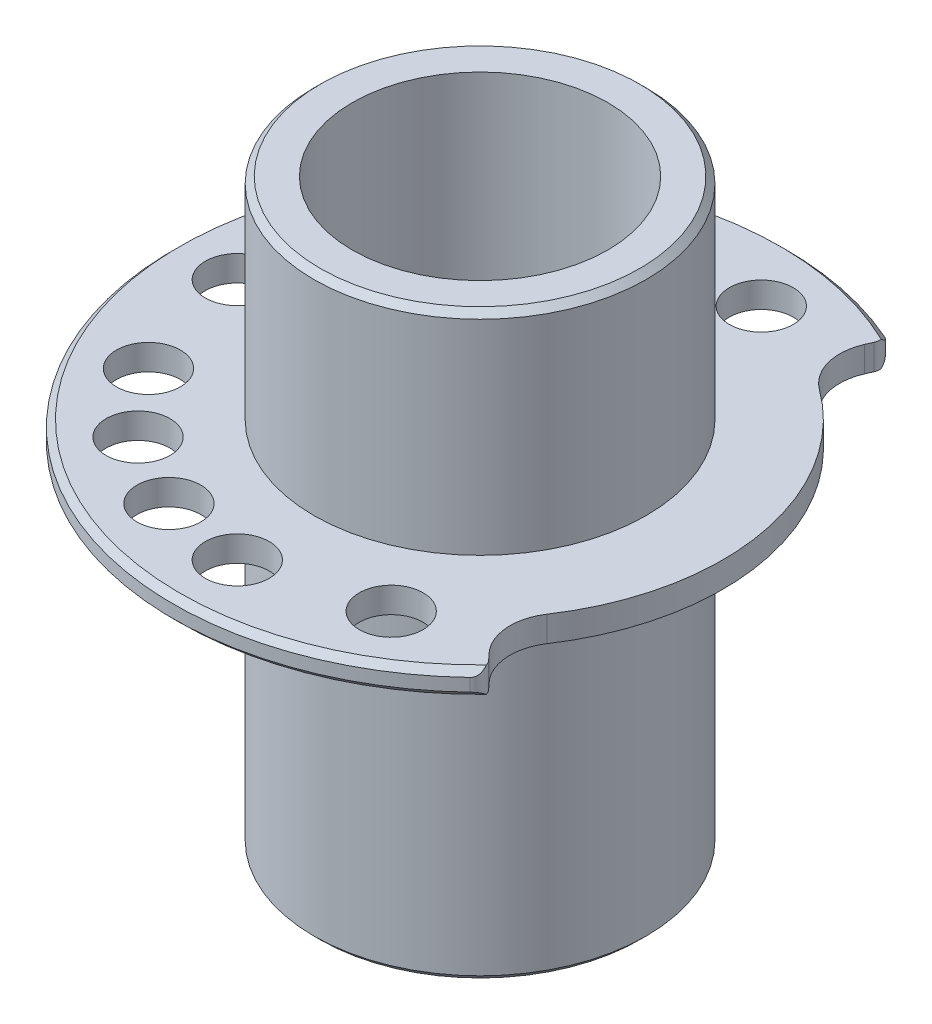
ISO-10303-21;
HEADER;
FILE_DESCRIPTION(('STEP AP214'),'2;1');
FILE_NAME('part.step','',(''),(''),'','','');
FILE_SCHEMA(('AUTOMOTIVE_DESIGN { 1 0 10303 214 1 1 1 1 }'));
ENDSEC;
DATA;
#1=APPLICATION_CONTEXT('core data for automotive mechanical design processes');
#2=APPLICATION_PROTOCOL_DEFINITION('international standard','automotive_design',2000,#1);
#3=PRODUCT_CONTEXT('',#1,'mechanical');
#4=PRODUCT('Part','Part','',(#3));
#5=PRODUCT_RELATED_PRODUCT_CATEGORY('part','',(#4));
#6=PRODUCT_DEFINITION_FORMATION('','',#4);
#7=PRODUCT_DEFINITION_CONTEXT('part definition',#1,'design');
#8=PRODUCT_DEFINITION('design','',#6,#7);
#9=PRODUCT_DEFINITION_SHAPE('','',#8);
#10=(LENGTH_UNIT() NAMED_UNIT(*) SI_UNIT(.MILLI.,.METRE.));
#11=(NAMED_UNIT(*) PLANE_ANGLE_UNIT() SI_UNIT($,.RADIAN.));
#12=(NAMED_UNIT(*) SI_UNIT($,.STERADIAN.) SOLID_ANGLE_UNIT());
#13=UNCERTAINTY_MEASURE_WITH_UNIT(LENGTH_MEASURE(1.E-05),#10,'distance_accuracy_value','');
#14=(GEOMETRIC_REPRESENTATION_CONTEXT(3) GLOBAL_UNCERTAINTY_ASSIGNED_CONTEXT((#13)) GLOBAL_UNIT_ASSIGNED_CONTEXT((#10,
#11,#12)) REPRESENTATION_CONTEXT('',''));
#15=CARTESIAN_POINT('',(0.,0.,0.));
#16=DIRECTION('',(0.,0.,1.));
#17=DIRECTION('',(1.,0.,0.));
#18=AXIS2_PLACEMENT_3D('',#15,#16,#17);
#19=CARTESIAN_POINT('',(0.,1.,0.));
#20=DIRECTION('',(0.,-1.,0.));
#21=DIRECTION('',(0.,0.,-1.));
#22=AXIS2_PLACEMENT_3D('',#19,#20,#21);
#23=CYLINDRICAL_SURFACE('',#22,10.);
#24=CARTESIAN_POINT('',(0.,-28.,0.));
#25=DIRECTION('',(0.,1.,0.));
#26=DIRECTION('',(0.,0.,1.));
#27=AXIS2_PLACEMENT_3D('',#24,#25,#26);
#28=CIRCLE('',#27,10.);
#29=CARTESIAN_POINT('',(0.,-28.,10.));
#30=VERTEX_POINT('',#29);
#31=EDGE_CURVE('E191',#30,#30,#28,.T.);
#32=ORIENTED_EDGE('',*,*,#31,.F.);
#33=EDGE_LOOP('',(#32));
#34=FACE_BOUND('',#33,.T.);
#35=CARTESIAN_POINT('',(0.,17.5,0.));
#36=DIRECTION('',(0.,1.,0.));
#37=DIRECTION('',(0.,0.,1.));
#38=AXIS2_PLACEMENT_3D('',#35,#36,#37);
#39=CIRCLE('',#38,10.);
#40=CARTESIAN_POINT('',(0.,17.5,10.));
#41=VERTEX_POINT('',#40);
#42=EDGE_CURVE('E186',#41,#41,#39,.T.);
#43=ORIENTED_EDGE('',*,*,#42,.T.);
#44=EDGE_LOOP('',(#43));
#45=FACE_BOUND('',#44,.T.);
#46=ADVANCED_FACE('F36',(#34,#45),#23,.F.);
#47=CARTESIAN_POINT('',(0.,1.,0.));
#48=DIRECTION('',(0.,-1.,0.));
#49=DIRECTION('',(0.,0.,-1.));
#50=AXIS2_PLACEMENT_3D('',#47,#48,#49);
#51=CYLINDRICAL_SURFACE('',#50,24.);
#52=CARTESIAN_POINT('',(0.,0.499999999999986,0.));
#53=DIRECTION('',(0.,1.,0.));
#54=DIRECTION('',(0.,0.,1.));
#55=AXIS2_PLACEMENT_3D('',#52,#53,#54);
#56=CIRCLE('',#55,24.);
#57=CARTESIAN_POINT('',(16.5812485743377,0.499999999999986,17.3511439310503));
#58=VERTEX_POINT('',#57);
#59=CARTESIAN_POINT('',(9.64683619455973,0.499999999999986,-21.9758629281158));
#60=VERTEX_POINT('',#59);
#61=EDGE_CURVE('E203',#58,#60,#56,.F.);
#62=ORIENTED_EDGE('',*,*,#61,.T.);
#63=DIRECTION('',(0.,-1.,0.));
#64=VECTOR('',#63,1.);
#65=CARTESIAN_POINT('',(9.64683619455973,1.,-21.9758629281158));
#66=LINE('',#65,#64);
#67=CARTESIAN_POINT('',(9.64683619455973,-0.499999999999993,-21.9758629281158));
#68=VERTEX_POINT('',#67);
#69=EDGE_CURVE('E335',#60,#68,#66,.T.);
#70=ORIENTED_EDGE('',*,*,#69,.T.);
#71=CARTESIAN_POINT('',(0.,-0.499999999999993,0.));
#72=DIRECTION('',(0.,1.,0.));
#73=DIRECTION('',(0.,0.,1.));
#74=AXIS2_PLACEMENT_3D('',#71,#72,#73);
#75=CIRCLE('',#74,24.);
#76=CARTESIAN_POINT('',(16.5812485743377,-0.499999999999993,17.3511439310503));
#77=VERTEX_POINT('',#76);
#78=EDGE_CURVE('E190',#68,#77,#75,.T.);
#79=ORIENTED_EDGE('',*,*,#78,.T.);
#80=DIRECTION('',(0.,-1.,0.));
#81=VECTOR('',#80,1.);
#82=CARTESIAN_POINT('',(16.5812485743377,1.,17.3511439310503));
#83=LINE('',#82,#81);
#84=EDGE_CURVE('E332',#77,#58,#83,.F.);
#85=ORIENTED_EDGE('',*,*,#84,.T.);
#86=EDGE_LOOP('',(#62,#70,#79,#85));
#87=FACE_BOUND('',#86,.T.);
#88=ADVANCED_FACE('F334',(#87),#51,.T.);
#89=CARTESIAN_POINT('',(0.,1.,0.));
#90=DIRECTION('',(0.,1.,0.));
#91=DIRECTION('',(0.,0.,1.));
#92=AXIS2_PLACEMENT_3D('',#89,#90,#91);
#93=PLANE('',#92);
#94=DIRECTION('',(-0.401951508106656,0.,0.915660955338156));
#95=VECTOR('',#94,1.);
#96=CARTESIAN_POINT('',(8.54215460267814,1.,-16.9714935920191));
#97=LINE('',#96,#95);
#98=CARTESIAN_POINT('',(10.1605456417912,1.,-20.6582504646709));
#99=VERTEX_POINT('',#98);
#100=CARTESIAN_POINT('',(9.93944993193131,1.,-20.1545859558223));
#101=VERTEX_POINT('',#100);
#102=EDGE_CURVE('E145',#99,#101,#97,.T.);
#103=ORIENTED_EDGE('',*,*,#102,.F.);
#104=CARTESIAN_POINT('',(9.24488468645307,1.,-21.0602019727776));
#105=DIRECTION('',(0.,1.,0.));
#106=DIRECTION('',(0.,0.,1.));
#107=AXIS2_PLACEMENT_3D('',#104,#105,#106);
#108=CIRCLE('',#107,1.);
#109=CARTESIAN_POINT('',(10.2407265560331,1.,-21.1513006598781));
#110=VERTEX_POINT('',#109);
#111=EDGE_CURVE('E255',#99,#110,#108,.T.);
#112=ORIENTED_EDGE('',*,*,#111,.T.);
#113=CARTESIAN_POINT('',(0.,1.,0.));
#114=DIRECTION('',(0.,1.,0.));
#115=DIRECTION('',(0.,0.,1.));
#116=AXIS2_PLACEMENT_3D('',#113,#114,#115);
#117=CIRCLE('',#116,23.5);
#118=CARTESIAN_POINT('',(16.8573060594065,1.,16.373186385658));
#119=VERTEX_POINT('',#118);
#120=EDGE_CURVE('E201',#110,#119,#117,.T.);
#121=ORIENTED_EDGE('',*,*,#120,.T.);
#122=CARTESIAN_POINT('',(15.8903632170736,1.,16.6281796005899));
#123=DIRECTION('',(0.,1.,0.));
#124=DIRECTION('',(0.,0.,1.));
#125=AXIS2_PLACEMENT_3D('',#122,#123,#124);
#126=CIRCLE('',#125,1.);
#127=CARTESIAN_POINT('',(16.6133275475341,1.,15.9372942433258));
#128=VERTEX_POINT('',#127);
#129=EDGE_CURVE('E140',#119,#128,#126,.T.);
#130=ORIENTED_EDGE('',*,*,#129,.T.);
#131=DIRECTION('',(0.690885357264071,0.,0.722964330460429));
#132=VECTOR('',#131,1.);
#133=CARTESIAN_POINT('',(13.8315923165422,1.,13.0263983506176));
#134=LINE('',#133,#132);
#135=CARTESIAN_POINT('',(16.2333021329868,1.,15.539623607384));
#136=VERTEX_POINT('',#135);
#137=EDGE_CURVE('E130',#136,#128,#134,.T.);
#138=ORIENTED_EDGE('',*,*,#137,.F.);
#139=CARTESIAN_POINT('',(19.1251594548285,1.,12.7760821783277));
#140=DIRECTION('',(0.,1.,0.));
#141=DIRECTION('',(0.,0.,1.));
#142=AXIS2_PLACEMENT_3D('',#139,#140,#141);
#143=CIRCLE('',#142,4.);
#144=CARTESIAN_POINT('',(15.7990447670323,1.,10.5541548429664));
#145=VERTEX_POINT('',#144);
#146=EDGE_CURVE('E116',#136,#145,#143,.F.);
#147=ORIENTED_EDGE('',*,*,#146,.T.);
#148=CARTESIAN_POINT('',(0.,1.,0.));
#149=DIRECTION('',(0.,-1.,0.));
#150=DIRECTION('',(0.,0.,1.));
#151=AXIS2_PLACEMENT_3D('',#148,#149,#150);
#152=CIRCLE('',#151,19.);
#153=CARTESIAN_POINT('',(11.2365122309737,1.,-15.3212529801965));
#154=VERTEX_POINT('',#153);
#155=EDGE_CURVE('E142',#154,#145,#152,.T.);
#156=ORIENTED_EDGE('',*,*,#155,.F.);
#157=CARTESIAN_POINT('',(13.6020937532839,1.,-18.5467799233957));
#158=DIRECTION('',(0.,1.,0.));
#159=DIRECTION('',(0.,0.,1.));
#160=AXIS2_PLACEMENT_3D('',#157,#158,#159);
#161=CIRCLE('',#160,4.);
#162=EDGE_CURVE('E246',#154,#101,#161,.F.);
#163=ORIENTED_EDGE('',*,*,#162,.T.);
#164=EDGE_LOOP('',(#103,#112,#121,#130,#138,#147,#156,#163));
#165=FACE_BOUND('',#164,.T.);
#166=CARTESIAN_POINT('',(-19.,1.,0.));
#167=DIRECTION('',(0.,1.,0.));
#168=DIRECTION('',(0.,0.,1.));
#169=AXIS2_PLACEMENT_3D('',#166,#167,#168);
#170=CIRCLE('',#169,2.5);
#171=CARTESIAN_POINT('',(-19.,1.,2.5));
#172=VERTEX_POINT('',#171);
#173=EDGE_CURVE('E183',#172,#172,#170,.T.);
#174=ORIENTED_EDGE('',*,*,#173,.F.);
#175=EDGE_LOOP('',(#174));
#176=FACE_BOUND('',#175,.T.);
#177=CARTESIAN_POINT('',(9.50000000000002,1.,16.4544826719043));
#178=DIRECTION('',(0.,1.,0.));
#179=DIRECTION('',(0.,0.,1.));
#180=AXIS2_PLACEMENT_3D('',#177,#178,#179);
#181=CIRCLE('',#180,2.5);
#182=CARTESIAN_POINT('',(9.50000000000002,1.,18.9544826719043));
#183=VERTEX_POINT('',#182);
#184=EDGE_CURVE('E179',#183,#183,#181,.T.);
#185=ORIENTED_EDGE('',*,*,#184,.F.);
#186=EDGE_LOOP('',(#185));
#187=FACE_BOUND('',#186,.T.);
#188=CARTESIAN_POINT('',(-6.49793606735281,1.,17.8529326181116));
#189=DIRECTION('',(0.,1.,0.));
#190=DIRECTION('',(0.,0.,1.));
#191=AXIS2_PLACEMENT_3D('',#188,#189,#190);
#192=CIRCLE('',#191,2.5);
#193=CARTESIAN_POINT('',(-6.49793606735281,1.,20.3529326181116));
#194=VERTEX_POINT('',#193);
#195=EDGE_CURVE('E175',#194,#194,#192,.T.);
#196=ORIENTED_EDGE('',*,*,#195,.F.);
#197=EDGE_LOOP('',(#196));
#198=FACE_BOUND('',#197,.T.);
#199=CARTESIAN_POINT('',(3.29931537567156,1.,-18.711347307232));
#200=DIRECTION('',(0.,1.,0.));
#201=DIRECTION('',(0.,0.,1.));
#202=AXIS2_PLACEMENT_3D('',#199,#200,#201);
#203=CIRCLE('',#202,2.5);
#204=CARTESIAN_POINT('',(3.29931537567156,1.,-16.211347307232));
#205=VERTEX_POINT('',#204);
#206=EDGE_CURVE('E171',#205,#205,#203,.T.);
#207=ORIENTED_EDGE('',*,*,#206,.F.);
#208=EDGE_LOOP('',(#207));
#209=FACE_BOUND('',#208,.T.);
#210=CARTESIAN_POINT('',(-16.4544826719044,1.,9.49999999999996));
#211=DIRECTION('',(0.,1.,0.));
#212=DIRECTION('',(0.,0.,1.));
#213=AXIS2_PLACEMENT_3D('',#210,#211,#212);
#214=CIRCLE('',#213,2.5);
#215=CARTESIAN_POINT('',(-16.4544826719044,1.,12.));
#216=VERTEX_POINT('',#215);
#217=EDGE_CURVE('E167',#216,#216,#214,.T.);
#218=ORIENTED_EDGE('',*,*,#217,.F.);
#219=EDGE_LOOP('',(#218));
#220=FACE_BOUND('',#219,.T.);
#221=CARTESIAN_POINT('',(-14.5754053366783,1.,-12.2302172422662));
#222=DIRECTION('',(0.,1.,0.));
#223=DIRECTION('',(0.,0.,1.));
#224=AXIS2_PLACEMENT_3D('',#221,#222,#223);
#225=CIRCLE('',#224,2.5);
#226=CARTESIAN_POINT('',(-14.5754053366783,1.,-9.73021724226621));
#227=VERTEX_POINT('',#226);
#228=EDGE_CURVE('E163',#227,#227,#225,.T.);
#229=ORIENTED_EDGE('',*,*,#228,.F.);
#230=EDGE_LOOP('',(#229));
#231=FACE_BOUND('',#230,.T.);
#232=CARTESIAN_POINT('',(-12.2129645840443,1.,14.5548444192606));
#233=DIRECTION('',(0.,1.,0.));
#234=DIRECTION('',(0.,0.,1.));
#235=AXIS2_PLACEMENT_3D('',#232,#233,#234);
#236=CIRCLE('',#235,2.5);
#237=CARTESIAN_POINT('',(-12.2129645840443,1.,17.0548444192606));
#238=VERTEX_POINT('',#237);
#239=EDGE_CURVE('E159',#238,#238,#236,.T.);
#240=ORIENTED_EDGE('',*,*,#239,.F.);
#241=EDGE_LOOP('',(#240));
#242=FACE_BOUND('',#241,.T.);
#243=CARTESIAN_POINT('',(-8.02974697307318,1.,-17.2198479536964));
#244=DIRECTION('',(0.,1.,0.));
#245=DIRECTION('',(0.,0.,1.));
#246=AXIS2_PLACEMENT_3D('',#243,#244,#245);
#247=CIRCLE('',#246,2.5);
#248=CARTESIAN_POINT('',(-8.02974697307318,1.,-14.7198479536964));
#249=VERTEX_POINT('',#248);
#250=EDGE_CURVE('E155',#249,#249,#247,.T.);
#251=ORIENTED_EDGE('',*,*,#250,.F.);
#252=EDGE_LOOP('',(#251));
#253=FACE_BOUND('',#252,.T.);
#254=CARTESIAN_POINT('',(0.,1.,19.));
#255=DIRECTION('',(0.,1.,0.));
#256=DIRECTION('',(0.,0.,1.));
#257=AXIS2_PLACEMENT_3D('',#254,#255,#256);
#258=CIRCLE('',#257,2.5);
#259=CARTESIAN_POINT('',(0.,1.,21.5));
#260=VERTEX_POINT('',#259);
#261=EDGE_CURVE('E151',#260,#260,#258,.T.);
#262=ORIENTED_EDGE('',*,*,#261,.F.);
#263=EDGE_LOOP('',(#262));
#264=FACE_BOUND('',#263,.T.);
#265=CARTESIAN_POINT('',(0.,1.,0.));
#266=DIRECTION('',(0.,1.,0.));
#267=DIRECTION('',(0.,0.,1.));
#268=AXIS2_PLACEMENT_3D('',#265,#266,#267);
#269=CIRCLE('',#268,13.);
#270=CARTESIAN_POINT('',(0.,1.,13.));
#271=VERTEX_POINT('',#270);
#272=EDGE_CURVE('E194',#271,#271,#269,.F.);
#273=ORIENTED_EDGE('',*,*,#272,.T.);
#274=EDGE_LOOP('',(#273));
#275=FACE_BOUND('',#274,.T.);
#276=ADVANCED_FACE('F136',(#165,#176,#187,#198,#209,#220,#231,#242,#253,#264,#275),#93,.T.);
#277=CARTESIAN_POINT('',(0.,-1.,0.));
#278=DIRECTION('',(0.,1.,0.));
#279=DIRECTION('',(0.,0.,1.));
#280=AXIS2_PLACEMENT_3D('',#277,#278,#279);
#281=PLANE('',#280);
#282=CARTESIAN_POINT('',(-19.,-1.,0.));
#283=DIRECTION('',(0.,1.,0.));
#284=DIRECTION('',(0.,0.,1.));
#285=AXIS2_PLACEMENT_3D('',#282,#283,#284);
#286=CIRCLE('',#285,2.5);
#287=CARTESIAN_POINT('',(-19.,-1.,2.5));
#288=VERTEX_POINT('',#287);
#289=EDGE_CURVE('E182',#288,#288,#286,.T.);
#290=ORIENTED_EDGE('',*,*,#289,.T.);
#291=EDGE_LOOP('',(#290));
#292=FACE_BOUND('',#291,.T.);
#293=CARTESIAN_POINT('',(9.50000000000002,-1.,16.4544826719043));
#294=DIRECTION('',(0.,1.,0.));
#295=DIRECTION('',(0.,0.,1.));
#296=AXIS2_PLACEMENT_3D('',#293,#294,#295);
#297=CIRCLE('',#296,2.5);
#298=CARTESIAN_POINT('',(9.50000000000002,-1.,18.9544826719043));
#299=VERTEX_POINT('',#298);
#300=EDGE_CURVE('E178',#299,#299,#297,.T.);
#301=ORIENTED_EDGE('',*,*,#300,.T.);
#302=EDGE_LOOP('',(#301));
#303=FACE_BOUND('',#302,.T.);
#304=CARTESIAN_POINT('',(-6.49793606735281,-1.,17.8529326181116));
#305=DIRECTION('',(0.,1.,0.));
#306=DIRECTION('',(0.,0.,1.));
#307=AXIS2_PLACEMENT_3D('',#304,#305,#306);
#308=CIRCLE('',#307,2.5);
#309=CARTESIAN_POINT('',(-6.49793606735281,-1.,20.3529326181116));
#310=VERTEX_POINT('',#309);
#311=EDGE_CURVE('E174',#310,#310,#308,.T.);
#312=ORIENTED_EDGE('',*,*,#311,.T.);
#313=EDGE_LOOP('',(#312));
#314=FACE_BOUND('',#313,.T.);
#315=CARTESIAN_POINT('',(3.29931537567156,-1.,-18.711347307232));
#316=DIRECTION('',(0.,1.,0.));
#317=DIRECTION('',(0.,0.,1.));
#318=AXIS2_PLACEMENT_3D('',#315,#316,#317);
#319=CIRCLE('',#318,2.5);
#320=CARTESIAN_POINT('',(3.29931537567156,-1.,-16.211347307232));
#321=VERTEX_POINT('',#320);
#322=EDGE_CURVE('E170',#321,#321,#319,.T.);
#323=ORIENTED_EDGE('',*,*,#322,.T.);
#324=EDGE_LOOP('',(#323));
#325=FACE_BOUND('',#324,.T.);
#326=CARTESIAN_POINT('',(-16.4544826719044,-1.,9.49999999999996));
#327=DIRECTION('',(0.,1.,0.));
#328=DIRECTION('',(0.,0.,1.));
#329=AXIS2_PLACEMENT_3D('',#326,#327,#328);
#330=CIRCLE('',#329,2.5);
#331=CARTESIAN_POINT('',(-16.4544826719044,-1.,12.));
#332=VERTEX_POINT('',#331);
#333=EDGE_CURVE('E166',#332,#332,#330,.T.);
#334=ORIENTED_EDGE('',*,*,#333,.T.);
#335=EDGE_LOOP('',(#334));
#336=FACE_BOUND('',#335,.T.);
#337=CARTESIAN_POINT('',(-14.5754053366783,-1.,-12.2302172422662));
#338=DIRECTION('',(0.,1.,0.));
#339=DIRECTION('',(0.,0.,1.));
#340=AXIS2_PLACEMENT_3D('',#337,#338,#339);
#341=CIRCLE('',#340,2.5);
#342=CARTESIAN_POINT('',(-14.5754053366783,-1.,-9.73021724226621));
#343=VERTEX_POINT('',#342);
#344=EDGE_CURVE('E162',#343,#343,#341,.T.);
#345=ORIENTED_EDGE('',*,*,#344,.T.);
#346=EDGE_LOOP('',(#345));
#347=FACE_BOUND('',#346,.T.);
#348=CARTESIAN_POINT('',(-12.2129645840443,-1.,14.5548444192606));
#349=DIRECTION('',(0.,1.,0.));
#350=DIRECTION('',(0.,0.,1.));
#351=AXIS2_PLACEMENT_3D('',#348,#349,#350);
#352=CIRCLE('',#351,2.5);
#353=CARTESIAN_POINT('',(-12.2129645840443,-1.,17.0548444192606));
#354=VERTEX_POINT('',#353);
#355=EDGE_CURVE('E158',#354,#354,#352,.T.);
#356=ORIENTED_EDGE('',*,*,#355,.T.);
#357=EDGE_LOOP('',(#356));
#358=FACE_BOUND('',#357,.T.);
#359=CARTESIAN_POINT('',(-8.02974697307318,-1.,-17.2198479536964));
#360=DIRECTION('',(0.,1.,0.));
#361=DIRECTION('',(0.,0.,1.));
#362=AXIS2_PLACEMENT_3D('',#359,#360,#361);
#363=CIRCLE('',#362,2.5);
#364=CARTESIAN_POINT('',(-8.02974697307318,-1.,-14.7198479536964));
#365=VERTEX_POINT('',#364);
#366=EDGE_CURVE('E154',#365,#365,#363,.T.);
#367=ORIENTED_EDGE('',*,*,#366,.T.);
#368=EDGE_LOOP('',(#367));
#369=FACE_BOUND('',#368,.T.);
#370=CARTESIAN_POINT('',(0.,-1.,19.));
#371=DIRECTION('',(0.,1.,0.));
#372=DIRECTION('',(0.,0.,1.));
#373=AXIS2_PLACEMENT_3D('',#370,#371,#372);
#374=CIRCLE('',#373,2.5);
#375=CARTESIAN_POINT('',(0.,-1.,21.5));
#376=VERTEX_POINT('',#375);
#377=EDGE_CURVE('E150',#376,#376,#374,.T.);
#378=ORIENTED_EDGE('',*,*,#377,.T.);
#379=EDGE_LOOP('',(#378));
#380=FACE_BOUND('',#379,.T.);
#381=CARTESIAN_POINT('',(0.,-1.,0.));
#382=DIRECTION('',(0.,1.,0.));
#383=DIRECTION('',(0.,0.,1.));
#384=AXIS2_PLACEMENT_3D('',#381,#382,#383);
#385=CIRCLE('',#384,23.5);
#386=CARTESIAN_POINT('',(16.8573060594065,-1.,16.373186385658));
#387=VERTEX_POINT('',#386);
#388=CARTESIAN_POINT('',(10.240726556033,-1.,-21.1513006598781));
#389=VERTEX_POINT('',#388);
#390=EDGE_CURVE('E199',#387,#389,#385,.F.);
#391=ORIENTED_EDGE('',*,*,#390,.T.);
#392=CARTESIAN_POINT('',(9.24488468645307,-1.,-21.0602019727776));
#393=DIRECTION('',(0.,1.,0.));
#394=DIRECTION('',(0.,0.,1.));
#395=AXIS2_PLACEMENT_3D('',#392,#393,#394);
#396=CIRCLE('',#395,1.);
#397=CARTESIAN_POINT('',(10.1605456417912,-1.,-20.6582504646709));
#398=VERTEX_POINT('',#397);
#399=EDGE_CURVE('E45',#389,#398,#396,.F.);
#400=ORIENTED_EDGE('',*,*,#399,.T.);
#401=DIRECTION('',(-0.401951508106656,0.,0.915660955338156));
#402=VECTOR('',#401,1.);
#403=CARTESIAN_POINT('',(0.915660955338128,-1.,0.401951508106644));
#404=LINE('',#403,#402);
#405=CARTESIAN_POINT('',(9.93944993193131,-1.,-20.1545859558223));
#406=VERTEX_POINT('',#405);
#407=EDGE_CURVE('E141',#398,#406,#404,.T.);
#408=ORIENTED_EDGE('',*,*,#407,.T.);
#409=CARTESIAN_POINT('',(13.6020937532839,-1.,-18.5467799233957));
#410=DIRECTION('',(0.,1.,0.));
#411=DIRECTION('',(0.,0.,1.));
#412=AXIS2_PLACEMENT_3D('',#409,#410,#411);
#413=CIRCLE('',#412,4.);
#414=CARTESIAN_POINT('',(11.2365122309737,-1.,-15.3212529801965));
#415=VERTEX_POINT('',#414);
#416=EDGE_CURVE('E249',#406,#415,#413,.T.);
#417=ORIENTED_EDGE('',*,*,#416,.T.);
#418=CARTESIAN_POINT('',(0.,-1.,0.));
#419=DIRECTION('',(0.,1.,0.));
#420=DIRECTION('',(0.,0.,1.));
#421=AXIS2_PLACEMENT_3D('',#418,#419,#420);
#422=CIRCLE('',#421,19.);
#423=CARTESIAN_POINT('',(15.7990447670323,-1.,10.5541548429664));
#424=VERTEX_POINT('',#423);
#425=EDGE_CURVE('E133',#415,#424,#422,.F.);
#426=ORIENTED_EDGE('',*,*,#425,.T.);
#427=CARTESIAN_POINT('',(19.1251594548285,-1.,12.7760821783277));
#428=DIRECTION('',(0.,1.,0.));
#429=DIRECTION('',(0.,0.,1.));
#430=AXIS2_PLACEMENT_3D('',#427,#428,#429);
#431=CIRCLE('',#430,4.);
#432=CARTESIAN_POINT('',(16.2333021329868,-1.,15.539623607384));
#433=VERTEX_POINT('',#432);
#434=EDGE_CURVE('E126',#424,#433,#431,.T.);
#435=ORIENTED_EDGE('',*,*,#434,.T.);
#436=DIRECTION('',(0.690885357264071,0.,0.722964330460429));
#437=VECTOR('',#436,1.);
#438=CARTESIAN_POINT('',(0.722964330460431,-1.,-0.690885357264073));
#439=LINE('',#438,#437);
#440=CARTESIAN_POINT('',(16.6133275475341,-1.,15.9372942433258));
#441=VERTEX_POINT('',#440);
#442=EDGE_CURVE('E131',#433,#441,#439,.T.);
#443=ORIENTED_EDGE('',*,*,#442,.T.);
#444=CARTESIAN_POINT('',(15.8903632170736,-1.,16.6281796005899));
#445=DIRECTION('',(0.,1.,0.));
#446=DIRECTION('',(0.,0.,1.));
#447=AXIS2_PLACEMENT_3D('',#444,#445,#446);
#448=CIRCLE('',#447,1.);
#449=EDGE_CURVE('E307',#441,#387,#448,.F.);
#450=ORIENTED_EDGE('',*,*,#449,.T.);
#451=EDGE_LOOP('',(#391,#400,#408,#417,#426,#435,#443,#450));
#452=FACE_BOUND('',#451,.T.);
#453=CARTESIAN_POINT('',(0.,-1.,0.));
#454=DIRECTION('',(0.,1.,0.));
#455=DIRECTION('',(0.,0.,1.));
#456=AXIS2_PLACEMENT_3D('',#453,#454,#455);
#457=CIRCLE('',#456,13.);
#458=CARTESIAN_POINT('',(0.,-1.,13.));
#459=VERTEX_POINT('',#458);
#460=EDGE_CURVE('E187',#459,#459,#457,.F.);
#461=ORIENTED_EDGE('',*,*,#460,.F.);
#462=EDGE_LOOP('',(#461));
#463=FACE_BOUND('',#462,.T.);
#464=ADVANCED_FACE('F317',(#292,#303,#314,#325,#336,#347,#358,#369,#380,#452,#463),#281,.F.);
#465=CARTESIAN_POINT('',(0.,-28.,0.));
#466=DIRECTION('',(0.,1.,0.));
#467=DIRECTION('',(0.,0.,1.));
#468=AXIS2_PLACEMENT_3D('',#465,#466,#467);
#469=CYLINDRICAL_SURFACE('',#468,13.);
#470=CARTESIAN_POINT('',(0.,-27.5,0.));
#471=DIRECTION('',(0.,1.,0.));
#472=DIRECTION('',(0.,0.,1.));
#473=AXIS2_PLACEMENT_3D('',#470,#471,#472);
#474=CIRCLE('',#473,13.);
#475=CARTESIAN_POINT('',(0.,-27.5,13.));
#476=VERTEX_POINT('',#475);
#477=EDGE_CURVE('E206',#476,#476,#474,.T.);
#478=ORIENTED_EDGE('',*,*,#477,.T.);
#479=EDGE_LOOP('',(#478));
#480=FACE_BOUND('',#479,.T.);
#481=ORIENTED_EDGE('',*,*,#460,.T.);
#482=EDGE_LOOP('',(#481));
#483=FACE_BOUND('',#482,.T.);
#484=ADVANCED_FACE('F368',(#480,#483),#469,.T.);
#485=CARTESIAN_POINT('',(0.,-28.,0.));
#486=DIRECTION('',(0.,1.,0.));
#487=DIRECTION('',(0.,0.,1.));
#488=AXIS2_PLACEMENT_3D('',#485,#486,#487);
#489=PLANE('',#488);
#490=CARTESIAN_POINT('',(0.,-28.,0.));
#491=DIRECTION('',(0.,1.,0.));
#492=DIRECTION('',(0.,0.,1.));
#493=AXIS2_PLACEMENT_3D('',#490,#491,#492);
#494=CIRCLE('',#493,12.5);
#495=CARTESIAN_POINT('',(0.,-28.,12.5));
#496=VERTEX_POINT('',#495);
#497=EDGE_CURVE('E209',#496,#496,#494,.F.);
#498=ORIENTED_EDGE('',*,*,#497,.T.);
#499=EDGE_LOOP('',(#498));
#500=FACE_BOUND('',#499,.T.);
#501=ORIENTED_EDGE('',*,*,#31,.T.);
#502=EDGE_LOOP('',(#501));
#503=FACE_BOUND('',#502,.T.);
#504=ADVANCED_FACE('F371',(#500,#503),#489,.F.);
#505=CARTESIAN_POINT('',(0.,17.5,0.));
#506=DIRECTION('',(0.,-1.,0.));
#507=DIRECTION('',(0.,0.,-1.));
#508=AXIS2_PLACEMENT_3D('',#505,#506,#507);
#509=CYLINDRICAL_SURFACE('',#508,13.);
#510=CARTESIAN_POINT('',(0.,17.,0.));
#511=DIRECTION('',(0.,1.,0.));
#512=DIRECTION('',(0.,0.,1.));
#513=AXIS2_PLACEMENT_3D('',#510,#511,#512);
#514=CIRCLE('',#513,13.);
#515=CARTESIAN_POINT('',(0.,17.,13.));
#516=VERTEX_POINT('',#515);
#517=EDGE_CURVE('E217',#516,#516,#514,.F.);
#518=ORIENTED_EDGE('',*,*,#517,.T.);
#519=EDGE_LOOP('',(#518));
#520=FACE_BOUND('',#519,.T.);
#521=ORIENTED_EDGE('',*,*,#272,.F.);
#522=EDGE_LOOP('',(#521));
#523=FACE_BOUND('',#522,.T.);
#524=ADVANCED_FACE('F363',(#520,#523),#509,.T.);
#525=CARTESIAN_POINT('',(0.,17.5,0.));
#526=DIRECTION('',(0.,1.,0.));
#527=DIRECTION('',(0.,0.,1.));
#528=AXIS2_PLACEMENT_3D('',#525,#526,#527);
#529=PLANE('',#528);
#530=CARTESIAN_POINT('',(0.,17.5,0.));
#531=DIRECTION('',(0.,1.,0.));
#532=DIRECTION('',(0.,0.,1.));
#533=AXIS2_PLACEMENT_3D('',#530,#531,#532);
#534=CIRCLE('',#533,12.5);
#535=CARTESIAN_POINT('',(0.,17.5,12.5));
#536=VERTEX_POINT('',#535);
#537=EDGE_CURVE('E212',#536,#536,#534,.T.);
#538=ORIENTED_EDGE('',*,*,#537,.T.);
#539=EDGE_LOOP('',(#538));
#540=FACE_BOUND('',#539,.T.);
#541=ORIENTED_EDGE('',*,*,#42,.F.);
#542=EDGE_LOOP('',(#541));
#543=FACE_BOUND('',#542,.T.);
#544=ADVANCED_FACE('F395',(#540,#543),#529,.T.);
#545=CARTESIAN_POINT('',(0.,-0.499999999999993,0.));
#546=DIRECTION('',(0.,1.,0.));
#547=DIRECTION('',(0.,0.,1.));
#548=AXIS2_PLACEMENT_3D('',#545,#546,#547);
#549=CONICAL_SURFACE('',#548,24.,0.785398163397448);
#550=ORIENTED_EDGE('',*,*,#78,.F.);
#551=CARTESIAN_POINT('',(9.64683619455973,-0.499999999999993,-21.9758629281158));
#552=CARTESIAN_POINT('',(9.66758984804915,-0.499997361037034,-21.9667557469492));
#553=CARTESIAN_POINT('',(9.68801870677943,-0.50073901557201,-21.9569426830524));
#554=CARTESIAN_POINT('',(9.72806951515627,-0.503679050760108,-21.9360112311293));
#555=CARTESIAN_POINT('',(9.74769203051387,-0.505876390946741,-21.9248937800943));
#556=CARTESIAN_POINT('',(9.80482128402231,-0.514554642289489,-21.8899294312927));
#557=CARTESIAN_POINT('',(9.84095947165225,-0.523123058893588,-21.864306742837));
#558=CARTESIAN_POINT('',(9.90852139929597,-0.545204066509054,-21.8095214595563));
#559=CARTESIAN_POINT('',(9.93995625903215,-0.558704727651295,-21.7803675187447));
#560=CARTESIAN_POINT('',(9.99795300071954,-0.58988160895553,-21.7194895383163));
#561=CARTESIAN_POINT('',(10.0245055787625,-0.607565657570444,-21.6877607543763));
#562=CARTESIAN_POINT('',(10.0819155269648,-0.653741602025029,-21.6102161421117));
#563=CARTESIAN_POINT('',(10.1105252546683,-0.683778607625031,-21.5636601358511));
#564=CARTESIAN_POINT('',(10.1589692895946,-0.748589977364394,-21.4692011383698));
#565=CARTESIAN_POINT('',(10.1787777968114,-0.783377883709377,-21.4212946191054));
#566=CARTESIAN_POINT('',(10.2069074352445,-0.848256495368915,-21.3359966590808));
#567=CARTESIAN_POINT('',(10.2167963896843,-0.877699399901134,-21.2986080386712));
#568=CARTESIAN_POINT('',(10.2320174867299,-0.937917745163764,-21.2244680115807));
#569=CARTESIAN_POINT('',(10.2373849976941,-0.968680826753673,-21.1877139044758));
#570=CARTESIAN_POINT('',(10.2407265560331,-1.,-21.1513006598781));
#571=B_SPLINE_CURVE_WITH_KNOTS('',3,(#551,#552,#553,#554,#555,#556,#557,#558,#559,#560,#561,
#562,#563,#564,#565,#566,#567,#568,#569,#570),.UNSPECIFIED.,.F.,.F.,(4,2,2,2,2,2,2,2,2,4),(0.,
0.0679405744702415,0.135832640025221,0.270422297460947,0.404688548355429,0.539208070008987,
0.725260368227983,0.911854521029675,1.05744283770831,1.2018814462198),.UNSPECIFIED.);
#572=EDGE_CURVE('E58',#68,#389,#571,.T.);
#573=ORIENTED_EDGE('',*,*,#572,.T.);
#574=ORIENTED_EDGE('',*,*,#390,.F.);
#575=CARTESIAN_POINT('',(16.8573060594065,-1.,16.373186385658));
#576=CARTESIAN_POINT('',(16.8735922975908,-0.945201522056867,16.4350495621519));
#577=CARTESIAN_POINT('',(16.884497641289,-0.89172513941164,16.5004934413562));
#578=CARTESIAN_POINT('',(16.8927081206713,-0.790105731591417,16.6372419226301));
#579=CARTESIAN_POINT('',(16.8898584888547,-0.742029656568498,16.7086042970451));
#580=CARTESIAN_POINT('',(16.8717527211867,-0.672652336883968,16.8252102554568));
#581=CARTESIAN_POINT('',(16.8619213448272,-0.648338287076315,16.8694702536931));
#582=CARTESIAN_POINT('',(16.8354978648298,-0.604190876331415,16.9581059214783));
#583=CARTESIAN_POINT('',(16.8189256859053,-0.584344575743717,17.0024808704156));
#584=CARTESIAN_POINT('',(16.7783206270313,-0.550016969222432,17.090691247808));
#585=CARTESIAN_POINT('',(16.7541976070166,-0.535605386631852,17.1345131222569));
#586=CARTESIAN_POINT('',(16.6986419857441,-0.513738200910342,17.2191325895594));
#587=CARTESIAN_POINT('',(16.6672300005286,-0.506263270882027,17.2599382919393));
#588=CARTESIAN_POINT('',(16.624486783091,-0.501742788643553,17.3073089386718));
#589=CARTESIAN_POINT('',(16.6160673877921,-0.501089435517572,17.3162977013591));
#590=CARTESIAN_POINT('',(16.5989014627632,-0.500218845265944,17.3339584451264));
#591=CARTESIAN_POINT('',(16.5901553316989,-0.50000109327631,17.3426307882795));
#592=CARTESIAN_POINT('',(16.5812485743377,-0.499999999999995,17.3511439310503));
#593=B_SPLINE_CURVE_WITH_KNOTS('',3,(#575,#576,#577,#578,#579,#580,#581,#582,#583,#584,#585,
#586,#587,#588,#589,#590,#591,#592),.UNSPECIFIED.,.F.,.F.,(4,2,2,2,2,2,2,2,4),(0.,
0.253646710119168,0.510153997792851,0.66394979777317,0.817294268226541,0.972544028023258,
1.12735992077598,1.16435003442974,1.20129640128145),.UNSPECIFIED.);
#594=EDGE_CURVE('E308',#387,#77,#593,.T.);
#595=ORIENTED_EDGE('',*,*,#594,.T.);
#596=EDGE_LOOP('',(#550,#573,#574,#595));
#597=FACE_BOUND('',#596,.T.);
#598=ADVANCED_FACE('F276',(#597),#549,.T.);
#599=CARTESIAN_POINT('',(0.,1.,0.));
#600=DIRECTION('',(0.,-1.,0.));
#601=DIRECTION('',(0.,0.,-1.));
#602=AXIS2_PLACEMENT_3D('',#599,#600,#601);
#603=CONICAL_SURFACE('',#602,23.5,0.785398163397438);
#604=ORIENTED_EDGE('',*,*,#120,.F.);
#605=CARTESIAN_POINT('',(10.2407265560331,1.,-21.1513006598781));
#606=CARTESIAN_POINT('',(10.2348721613842,0.945201522056869,-21.2150032518458));
#607=CARTESIAN_POINT('',(10.2227367074392,0.891725139411642,-21.2802302294244));
#608=CARTESIAN_POINT('',(10.1836812991631,0.790105731591417,-21.4115399175162));
#609=CARTESIAN_POINT('',(10.1565961516476,0.742029656568497,-21.4776239826734));
#610=CARTESIAN_POINT('',(10.0997007087677,0.672652336883965,-21.5810052040798));
#611=CARTESIAN_POINT('',(10.0753244260101,0.648338287076312,-21.6192334690669));
#612=CARTESIAN_POINT('',(10.0201792930415,0.604190876331412,-21.6934863896072));
#613=CARTESIAN_POINT('',(9.98942941240017,0.584344575743713,-21.7295171826603));
#614=CARTESIAN_POINT('',(9.92110341229107,0.55001696922243,-21.7985200753168));
#615=CARTESIAN_POINT('',(9.88344722461237,0.535605386631851,-21.8314486086026));
#616=CARTESIAN_POINT('',(9.80230045492452,0.513738200910338,-21.8919637560514));
#617=CARTESIAN_POINT('',(9.75882647203681,0.50626327088202,-21.9195650417783));
#618=CARTESIAN_POINT('',(9.70245927063717,0.501742788643547,-21.9494598476004));
#619=CARTESIAN_POINT('',(9.69147328910063,0.501089435517567,-21.9550269187808));
#620=CARTESIAN_POINT('',(9.66930226590752,0.500218845265939,-21.9657514972379));
#621=CARTESIAN_POINT('',(9.65811747503776,0.500001093276305,-21.9709094811036));
#622=CARTESIAN_POINT('',(9.64683619455973,0.499999999999988,-21.9758629281158));
#623=B_SPLINE_CURVE_WITH_KNOTS('',3,(#605,#606,#607,#608,#609,#610,#611,#612,#613,#614,#615,
#616,#617,#618,#619,#620,#621,#622),.UNSPECIFIED.,.F.,.F.,(4,2,2,2,2,2,2,2,4),(0.,
0.253646710119166,0.51015399779285,0.663949797773166,0.817294268226537,0.97254402802325,
1.12735992077597,1.16435003442974,1.20129640128145),.UNSPECIFIED.);
#624=EDGE_CURVE('E264',#110,#60,#623,.T.);
#625=ORIENTED_EDGE('',*,*,#624,.T.);
#626=ORIENTED_EDGE('',*,*,#61,.F.);
#627=CARTESIAN_POINT('',(16.5812485743377,0.499999999999986,17.3511439310503));
#628=CARTESIAN_POINT('',(16.5976357899682,0.499997361037026,17.3354878125709));
#629=CARTESIAN_POINT('',(16.6134763722477,0.500739015572001,17.3192794676489));
#630=CARTESIAN_POINT('',(16.6439528431491,0.5036790507601,17.2859121535131));
#631=CARTESIAN_POINT('',(16.6585895838355,0.505876390946733,17.2687538712985));
#632=CARTESIAN_POINT('',(16.7003150102,0.514554642289483,17.2163587752661));
#633=CARTESIAN_POINT('',(16.7255103228664,0.523123058893582,17.1799213358868));
#634=CARTESIAN_POINT('',(16.7702600972795,0.545204066509049,17.1053324692842));
#635=CARTESIAN_POINT('',(16.7898279679941,0.55870472765129,17.0671853710043));
#636=CARTESIAN_POINT('',(16.8235055825959,0.589881608955525,16.9901427281231));
#637=CARTESIAN_POINT('',(16.8376049610151,0.607565657570438,16.9512459074402));
#638=CARTESIAN_POINT('',(16.8650308462995,0.653741602025023,16.858742448801));
#639=CARTESIAN_POINT('',(16.8759921043713,0.683778607625026,16.805209010095));
#640=CARTESIAN_POINT('',(16.8892077266556,0.748589977364391,16.6998777514262));
#641=CARTESIAN_POINT('',(16.891436640131,0.783377883709374,16.6480854403085));
#642=CARTESIAN_POINT('',(16.888696233279,0.848256495368914,16.5583106737368));
#643=CARTESIAN_POINT('',(16.8852011494821,0.877699399901132,16.5197946414217));
#644=CARTESIAN_POINT('',(16.8741469193645,0.937917745163763,16.4449198832667));
#645=CARTESIAN_POINT('',(16.8666200848297,0.968680826753672,16.4085465231674));
#646=CARTESIAN_POINT('',(16.8573060594065,1.,16.373186385658));
#647=B_SPLINE_CURVE_WITH_KNOTS('',3,(#627,#628,#629,#630,#631,#632,#633,#634,#635,#636,#637,
#638,#639,#640,#641,#642,#643,#644,#645,#646),.UNSPECIFIED.,.F.,.F.,(4,2,2,2,2,2,2,2,2,4),(0.,
0.0679405744702413,0.135832640025225,0.270422297460949,0.404688548355431,0.539208070008989,
0.725260368227985,0.91185452102968,1.05744283770831,1.20188144621981),.UNSPECIFIED.);
#648=EDGE_CURVE('E257',#58,#119,#647,.T.);
#649=ORIENTED_EDGE('',*,*,#648,.T.);
#650=EDGE_LOOP('',(#604,#625,#626,#649));
#651=FACE_BOUND('',#650,.T.);
#652=ADVANCED_FACE('F270',(#651),#603,.T.);
#653=CARTESIAN_POINT('',(0.,-27.5,0.));
#654=DIRECTION('',(0.,1.,0.));
#655=DIRECTION('',(0.,0.,1.));
#656=AXIS2_PLACEMENT_3D('',#653,#654,#655);
#657=CONICAL_SURFACE('',#656,13.,0.785398163397453);
#658=ORIENTED_EDGE('',*,*,#497,.F.);
#659=EDGE_LOOP('',(#658));
#660=FACE_BOUND('',#659,.T.);
#661=ORIENTED_EDGE('',*,*,#477,.F.);
#662=EDGE_LOOP('',(#661));
#663=FACE_BOUND('',#662,.T.);
#664=ADVANCED_FACE('F275',(#660,#663),#657,.T.);
#665=CARTESIAN_POINT('',(0.,17.5,0.));
#666=DIRECTION('',(0.,-1.,0.));
#667=DIRECTION('',(0.,0.,-1.));
#668=AXIS2_PLACEMENT_3D('',#665,#666,#667);
#669=CONICAL_SURFACE('',#668,12.5,0.785398163397452);
#670=ORIENTED_EDGE('',*,*,#517,.F.);
#671=EDGE_LOOP('',(#670));
#672=FACE_BOUND('',#671,.T.);
#673=ORIENTED_EDGE('',*,*,#537,.F.);
#674=EDGE_LOOP('',(#673));
#675=FACE_BOUND('',#674,.T.);
#676=ADVANCED_FACE('F283',(#672,#675),#669,.T.);
#677=CARTESIAN_POINT('',(0.,17.5,19.));
#678=DIRECTION('',(0.,-1.,0.));
#679=DIRECTION('',(0.,0.,-1.));
#680=AXIS2_PLACEMENT_3D('',#677,#678,#679);
#681=CYLINDRICAL_SURFACE('',#680,2.5);
#682=ORIENTED_EDGE('',*,*,#261,.T.);
#683=EDGE_LOOP('',(#682));
#684=FACE_BOUND('',#683,.T.);
#685=ORIENTED_EDGE('',*,*,#377,.F.);
#686=EDGE_LOOP('',(#685));
#687=FACE_BOUND('',#686,.T.);
#688=ADVANCED_FACE('F287',(#684,#687),#681,.F.);
#689=CARTESIAN_POINT('',(-8.02974697307318,17.5,-17.2198479536964));
#690=DIRECTION('',(0.,-1.,0.));
#691=DIRECTION('',(0.,0.,-1.));
#692=AXIS2_PLACEMENT_3D('',#689,#690,#691);
#693=CYLINDRICAL_SURFACE('',#692,2.5);
#694=ORIENTED_EDGE('',*,*,#250,.T.);
#695=EDGE_LOOP('',(#694));
#696=FACE_BOUND('',#695,.T.);
#697=ORIENTED_EDGE('',*,*,#366,.F.);
#698=EDGE_LOOP('',(#697));
#699=FACE_BOUND('',#698,.T.);
#700=ADVANCED_FACE('F425',(#696,#699),#693,.F.);
#701=CARTESIAN_POINT('',(-12.2129645840443,17.5,14.5548444192606));
#702=DIRECTION('',(0.,-1.,0.));
#703=DIRECTION('',(0.,0.,-1.));
#704=AXIS2_PLACEMENT_3D('',#701,#702,#703);
#705=CYLINDRICAL_SURFACE('',#704,2.5);
#706=ORIENTED_EDGE('',*,*,#239,.T.);
#707=EDGE_LOOP('',(#706));
#708=FACE_BOUND('',#707,.T.);
#709=ORIENTED_EDGE('',*,*,#355,.F.);
#710=EDGE_LOOP('',(#709));
#711=FACE_BOUND('',#710,.T.);
#712=ADVANCED_FACE('F433',(#708,#711),#705,.F.);
#713=CARTESIAN_POINT('',(-14.5754053366783,17.5,-12.2302172422662));
#714=DIRECTION('',(0.,-1.,0.));
#715=DIRECTION('',(0.,0.,-1.));
#716=AXIS2_PLACEMENT_3D('',#713,#714,#715);
#717=CYLINDRICAL_SURFACE('',#716,2.5);
#718=ORIENTED_EDGE('',*,*,#228,.T.);
#719=EDGE_LOOP('',(#718));
#720=FACE_BOUND('',#719,.T.);
#721=ORIENTED_EDGE('',*,*,#344,.F.);
#722=EDGE_LOOP('',(#721));
#723=FACE_BOUND('',#722,.T.);
#724=ADVANCED_FACE('F441',(#720,#723),#717,.F.);
#725=CARTESIAN_POINT('',(-16.4544826719044,17.5,9.49999999999996));
#726=DIRECTION('',(0.,-1.,0.));
#727=DIRECTION('',(0.,0.,-1.));
#728=AXIS2_PLACEMENT_3D('',#725,#726,#727);
#729=CYLINDRICAL_SURFACE('',#728,2.5);
#730=ORIENTED_EDGE('',*,*,#217,.T.);
#731=EDGE_LOOP('',(#730));
#732=FACE_BOUND('',#731,.T.);
#733=ORIENTED_EDGE('',*,*,#333,.F.);
#734=EDGE_LOOP('',(#733));
#735=FACE_BOUND('',#734,.T.);
#736=ADVANCED_FACE('F449',(#732,#735),#729,.F.);
#737=CARTESIAN_POINT('',(3.29931537567156,17.5,-18.711347307232));
#738=DIRECTION('',(0.,-1.,0.));
#739=DIRECTION('',(0.,0.,-1.));
#740=AXIS2_PLACEMENT_3D('',#737,#738,#739);
#741=CYLINDRICAL_SURFACE('',#740,2.5);
#742=ORIENTED_EDGE('',*,*,#206,.T.);
#743=EDGE_LOOP('',(#742));
#744=FACE_BOUND('',#743,.T.);
#745=ORIENTED_EDGE('',*,*,#322,.F.);
#746=EDGE_LOOP('',(#745));
#747=FACE_BOUND('',#746,.T.);
#748=ADVANCED_FACE('F457',(#744,#747),#741,.F.);
#749=CARTESIAN_POINT('',(-6.49793606735281,17.5,17.8529326181116));
#750=DIRECTION('',(0.,-1.,0.));
#751=DIRECTION('',(0.,0.,-1.));
#752=AXIS2_PLACEMENT_3D('',#749,#750,#751);
#753=CYLINDRICAL_SURFACE('',#752,2.5);
#754=ORIENTED_EDGE('',*,*,#195,.T.);
#755=EDGE_LOOP('',(#754));
#756=FACE_BOUND('',#755,.T.);
#757=ORIENTED_EDGE('',*,*,#311,.F.);
#758=EDGE_LOOP('',(#757));
#759=FACE_BOUND('',#758,.T.);
#760=ADVANCED_FACE('F465',(#756,#759),#753,.F.);
#761=CARTESIAN_POINT('',(9.50000000000002,17.5,16.4544826719043));
#762=DIRECTION('',(0.,-1.,0.));
#763=DIRECTION('',(0.,0.,-1.));
#764=AXIS2_PLACEMENT_3D('',#761,#762,#763);
#765=CYLINDRICAL_SURFACE('',#764,2.5);
#766=ORIENTED_EDGE('',*,*,#184,.T.);
#767=EDGE_LOOP('',(#766));
#768=FACE_BOUND('',#767,.T.);
#769=ORIENTED_EDGE('',*,*,#300,.F.);
#770=EDGE_LOOP('',(#769));
#771=FACE_BOUND('',#770,.T.);
#772=ADVANCED_FACE('F348',(#768,#771),#765,.F.);
#773=CARTESIAN_POINT('',(-19.,17.5,0.));
#774=DIRECTION('',(0.,-1.,0.));
#775=DIRECTION('',(0.,0.,-1.));
#776=AXIS2_PLACEMENT_3D('',#773,#774,#775);
#777=CYLINDRICAL_SURFACE('',#776,2.5);
#778=ORIENTED_EDGE('',*,*,#173,.T.);
#779=EDGE_LOOP('',(#778));
#780=FACE_BOUND('',#779,.T.);
#781=ORIENTED_EDGE('',*,*,#289,.F.);
#782=EDGE_LOOP('',(#781));
#783=FACE_BOUND('',#782,.T.);
#784=ADVANCED_FACE('F341',(#780,#783),#777,.F.);
#785=CARTESIAN_POINT('',(0.,-9.,0.));
#786=DIRECTION('',(0.,1.,0.));
#787=DIRECTION('',(0.,0.,1.));
#788=AXIS2_PLACEMENT_3D('',#785,#786,#787);
#789=CYLINDRICAL_SURFACE('',#788,19.);
#790=ORIENTED_EDGE('',*,*,#155,.T.);
#791=DIRECTION('',(0.,1.,0.));
#792=VECTOR('',#791,1.);
#793=CARTESIAN_POINT('',(15.7990447670323,-9.,10.5541548429664));
#794=LINE('',#793,#792);
#795=EDGE_CURVE('E121',#145,#424,#794,.F.);
#796=ORIENTED_EDGE('',*,*,#795,.T.);
#797=ORIENTED_EDGE('',*,*,#425,.F.);
#798=DIRECTION('',(0.,1.,0.));
#799=VECTOR('',#798,1.);
#800=CARTESIAN_POINT('',(11.2365122309737,-9.,-15.3212529801965));
#801=LINE('',#800,#799);
#802=EDGE_CURVE('E132',#415,#154,#801,.T.);
#803=ORIENTED_EDGE('',*,*,#802,.T.);
#804=EDGE_LOOP('',(#790,#796,#797,#803));
#805=FACE_BOUND('',#804,.T.);
#806=ADVANCED_FACE('F339',(#805),#789,.T.);
#807=CARTESIAN_POINT('',(13.8315923165422,-9.,13.0263983506176));
#808=DIRECTION('',(-0.722964330460429,0.,0.690885357264071));
#809=DIRECTION('',(0.690885357264071,0.,0.722964330460429));
#810=AXIS2_PLACEMENT_3D('',#807,#808,#809);
#811=PLANE('',#810);
#812=ORIENTED_EDGE('',*,*,#137,.T.);
#813=DIRECTION('',(0.,-1.,0.));
#814=VECTOR('',#813,1.);
#815=CARTESIAN_POINT('',(16.6133275475341,-9.,15.9372942433258));
#816=LINE('',#815,#814);
#817=EDGE_CURVE('E11',#128,#441,#816,.T.);
#818=ORIENTED_EDGE('',*,*,#817,.T.);
#819=ORIENTED_EDGE('',*,*,#442,.F.);
#820=DIRECTION('',(0.,-1.,0.));
#821=VECTOR('',#820,1.);
#822=CARTESIAN_POINT('',(16.2333021329868,1.,15.539623607384));
#823=LINE('',#822,#821);
#824=EDGE_CURVE('E120',#433,#136,#823,.F.);
#825=ORIENTED_EDGE('',*,*,#824,.T.);
#826=EDGE_LOOP('',(#812,#818,#819,#825));
#827=FACE_BOUND('',#826,.T.);
#828=ADVANCED_FACE('F129',(#827),#811,.F.);
#829=CARTESIAN_POINT('',(8.54215460267814,-9.,-16.9714935920191));
#830=DIRECTION('',(-0.915660955338156,0.,-0.401951508106656));
#831=DIRECTION('',(-0.401951508106656,0.,0.915660955338156));
#832=AXIS2_PLACEMENT_3D('',#829,#830,#831);
#833=PLANE('',#832);
#834=ORIENTED_EDGE('',*,*,#407,.F.);
#835=DIRECTION('',(0.,-1.,0.));
#836=VECTOR('',#835,1.);
#837=CARTESIAN_POINT('',(10.1605456417912,-9.,-20.6582504646709));
#838=LINE('',#837,#836);
#839=EDGE_CURVE('E251',#398,#99,#838,.F.);
#840=ORIENTED_EDGE('',*,*,#839,.T.);
#841=ORIENTED_EDGE('',*,*,#102,.T.);
#842=DIRECTION('',(0.,-1.,0.));
#843=VECTOR('',#842,1.);
#844=CARTESIAN_POINT('',(9.93944993193131,-1.,-20.1545859558223));
#845=LINE('',#844,#843);
#846=EDGE_CURVE('E127',#101,#406,#845,.T.);
#847=ORIENTED_EDGE('',*,*,#846,.T.);
#848=EDGE_LOOP('',(#834,#840,#841,#847));
#849=FACE_BOUND('',#848,.T.);
#850=ADVANCED_FACE('F292',(#849),#833,.F.);
#851=CARTESIAN_POINT('',(19.1251594548285,-9.,12.7760821783277));
#852=DIRECTION('',(0.,1.,0.));
#853=DIRECTION('',(0.,0.,1.));
#854=AXIS2_PLACEMENT_3D('',#851,#852,#853);
#855=CYLINDRICAL_SURFACE('',#854,4.);
#856=ORIENTED_EDGE('',*,*,#434,.F.);
#857=ORIENTED_EDGE('',*,*,#795,.F.);
#858=ORIENTED_EDGE('',*,*,#146,.F.);
#859=ORIENTED_EDGE('',*,*,#824,.F.);
#860=EDGE_LOOP('',(#856,#857,#858,#859));
#861=FACE_BOUND('',#860,.T.);
#862=ADVANCED_FACE('F119',(#861),#855,.F.);
#863=CARTESIAN_POINT('',(13.6020937532839,-9.,-18.5467799233957));
#864=DIRECTION('',(0.,1.,0.));
#865=DIRECTION('',(0.,0.,1.));
#866=AXIS2_PLACEMENT_3D('',#863,#864,#865);
#867=CYLINDRICAL_SURFACE('',#866,4.);
#868=ORIENTED_EDGE('',*,*,#416,.F.);
#869=ORIENTED_EDGE('',*,*,#846,.F.);
#870=ORIENTED_EDGE('',*,*,#162,.F.);
#871=ORIENTED_EDGE('',*,*,#802,.F.);
#872=EDGE_LOOP('',(#868,#869,#870,#871));
#873=FACE_BOUND('',#872,.T.);
#874=ADVANCED_FACE('F291',(#873),#867,.F.);
#875=CARTESIAN_POINT('',(9.24488468645307,1.,-21.0602019727776));
#876=DIRECTION('',(0.,-1.,0.));
#877=DIRECTION('',(0.,0.,-1.));
#878=AXIS2_PLACEMENT_3D('',#875,#876,#877);
#879=CYLINDRICAL_SURFACE('',#878,1.);
#880=ORIENTED_EDGE('',*,*,#572,.F.);
#881=ORIENTED_EDGE('',*,*,#69,.F.);
#882=ORIENTED_EDGE('',*,*,#624,.F.);
#883=ORIENTED_EDGE('',*,*,#111,.F.);
#884=ORIENTED_EDGE('',*,*,#839,.F.);
#885=ORIENTED_EDGE('',*,*,#399,.F.);
#886=EDGE_LOOP('',(#880,#881,#882,#883,#884,#885));
#887=FACE_BOUND('',#886,.T.);
#888=ADVANCED_FACE('F294',(#887),#879,.T.);
#889=CARTESIAN_POINT('',(15.8903632170736,1.,16.6281796005899));
#890=DIRECTION('',(0.,-1.,0.));
#891=DIRECTION('',(0.,0.,-1.));
#892=AXIS2_PLACEMENT_3D('',#889,#890,#891);
#893=CYLINDRICAL_SURFACE('',#892,1.);
#894=ORIENTED_EDGE('',*,*,#449,.F.);
#895=ORIENTED_EDGE('',*,*,#817,.F.);
#896=ORIENTED_EDGE('',*,*,#129,.F.);
#897=ORIENTED_EDGE('',*,*,#648,.F.);
#898=ORIENTED_EDGE('',*,*,#84,.F.);
#899=ORIENTED_EDGE('',*,*,#594,.F.);
#900=EDGE_LOOP('',(#894,#895,#896,#897,#898,#899));
#901=FACE_BOUND('',#900,.T.);
#902=ADVANCED_FACE('F38',(#901),#893,.T.);
#903=CLOSED_SHELL('',(#46,#88,#276,#464,#484,#504,#524,#544,#598,#652,#664,#676,#688,#700,#712,
#724,#736,#748,#760,#772,#784,#806,#828,#850,#862,#874,#888,#902));
#904=MANIFOLD_SOLID_BREP('B2',#903);
#905=ADVANCED_BREP_SHAPE_REPRESENTATION('',(#18,#904),#14);
#906=SHAPE_DEFINITION_REPRESENTATION(#9,#905);
ENDSEC;
END-ISO-10303-21;
